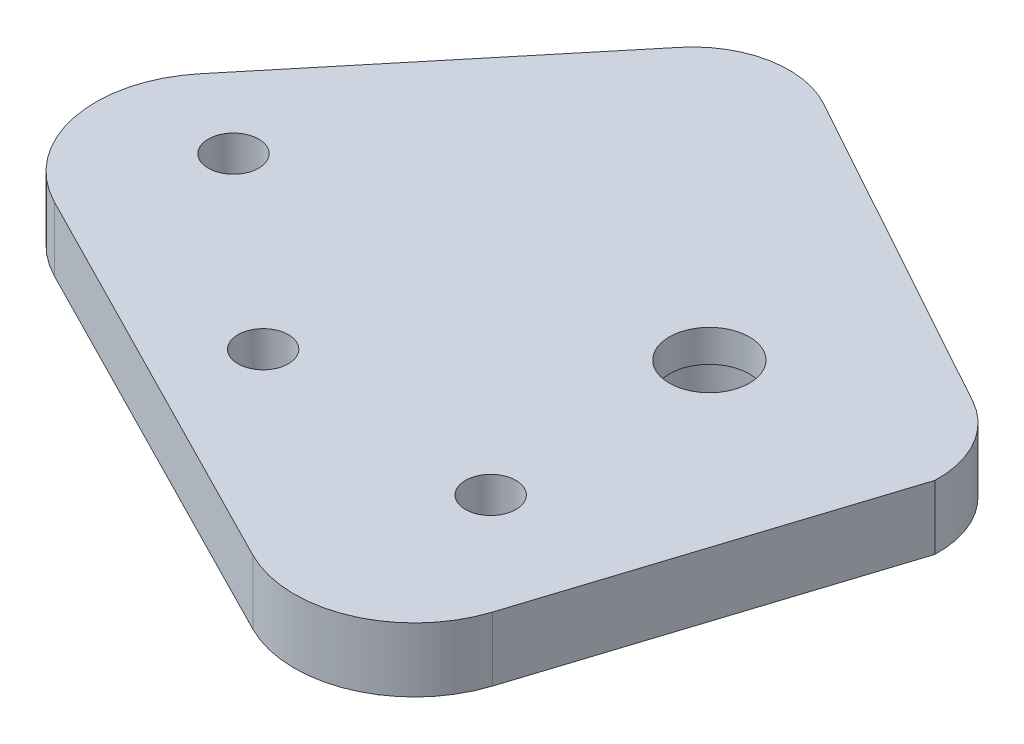
ISO-10303-21;
HEADER;
FILE_DESCRIPTION(('STEP AP214'),'2;1');
FILE_NAME('part.step','',(''),(''),'','','');
FILE_SCHEMA(('AUTOMOTIVE_DESIGN { 1 0 10303 214 1 1 1 1 }'));
ENDSEC;
DATA;
#1=APPLICATION_CONTEXT('core data for automotive mechanical design processes');
#2=APPLICATION_PROTOCOL_DEFINITION('international standard','automotive_design',2000,#1);
#3=PRODUCT_CONTEXT('',#1,'mechanical');
#4=PRODUCT('Part','Part','',(#3));
#5=PRODUCT_RELATED_PRODUCT_CATEGORY('part','',(#4));
#6=PRODUCT_DEFINITION_FORMATION('','',#4);
#7=PRODUCT_DEFINITION_CONTEXT('part definition',#1,'design');
#8=PRODUCT_DEFINITION('design','',#6,#7);
#9=PRODUCT_DEFINITION_SHAPE('','',#8);
#10=(LENGTH_UNIT() NAMED_UNIT(*) SI_UNIT(.MILLI.,.METRE.));
#11=(NAMED_UNIT(*) PLANE_ANGLE_UNIT() SI_UNIT($,.RADIAN.));
#12=(NAMED_UNIT(*) SI_UNIT($,.STERADIAN.) SOLID_ANGLE_UNIT());
#13=UNCERTAINTY_MEASURE_WITH_UNIT(LENGTH_MEASURE(1.E-05),#10,'distance_accuracy_value','');
#14=(GEOMETRIC_REPRESENTATION_CONTEXT(3) GLOBAL_UNCERTAINTY_ASSIGNED_CONTEXT((#13)) GLOBAL_UNIT_ASSIGNED_CONTEXT((#10,
#11,#12)) REPRESENTATION_CONTEXT('',''));
#15=CARTESIAN_POINT('',(0.,0.,0.));
#16=DIRECTION('',(0.,0.,1.));
#17=DIRECTION('',(1.,0.,0.));
#18=AXIS2_PLACEMENT_3D('',#15,#16,#17);
#19=CARTESIAN_POINT('',(28.0062938228443,10.,-31.6875316279944));
#20=DIRECTION('',(0.,-1.,0.));
#21=DIRECTION('',(0.,0.,-1.));
#22=AXIS2_PLACEMENT_3D('',#19,#20,#21);
#23=CYLINDRICAL_SURFACE('',#22,5.);
#24=CARTESIAN_POINT('',(28.0062938228443,8.,-31.6875316279944));
#25=DIRECTION('',(0.,1.,0.));
#26=DIRECTION('',(0.,0.,1.));
#27=AXIS2_PLACEMENT_3D('',#24,#25,#26);
#28=CIRCLE('',#27,5.);
#29=CARTESIAN_POINT('',(28.0062938228443,8.,-26.6875316279944));
#30=VERTEX_POINT('',#29);
#31=EDGE_CURVE('E129',#30,#30,#28,.T.);
#32=ORIENTED_EDGE('',*,*,#31,.T.);
#33=EDGE_LOOP('',(#32));
#34=FACE_BOUND('',#33,.T.);
#35=CARTESIAN_POINT('',(28.0062938228443,4.,-31.6875316279944));
#36=DIRECTION('',(0.,-1.,0.));
#37=DIRECTION('',(0.,0.,-1.));
#38=AXIS2_PLACEMENT_3D('',#35,#36,#37);
#39=CIRCLE('',#38,5.);
#40=CARTESIAN_POINT('',(28.0062938228443,4.,-36.6875316279944));
#41=VERTEX_POINT('',#40);
#42=EDGE_CURVE('E134',#41,#41,#39,.F.);
#43=ORIENTED_EDGE('',*,*,#42,.F.);
#44=EDGE_LOOP('',(#43));
#45=FACE_BOUND('',#44,.T.);
#46=ADVANCED_FACE('F35',(#34,#45),#23,.F.);
#47=CARTESIAN_POINT('',(0.,8.,0.));
#48=DIRECTION('',(0.,1.,0.));
#49=DIRECTION('',(0.,0.,1.));
#50=AXIS2_PLACEMENT_3D('',#47,#48,#49);
#51=PLANE('',#50);
#52=CARTESIAN_POINT('',(-0.992606529105151,8.,-5.0236580569629));
#53=DIRECTION('',(0.,1.,0.));
#54=DIRECTION('',(0.,0.,1.));
#55=AXIS2_PLACEMENT_3D('',#52,#53,#54);
#56=CIRCLE('',#55,3.15);
#57=CARTESIAN_POINT('',(-0.992606529105151,8.,-1.8736580569629));
#58=VERTEX_POINT('',#57);
#59=EDGE_CURVE('E184',#58,#58,#56,.T.);
#60=ORIENTED_EDGE('',*,*,#59,.F.);
#61=EDGE_LOOP('',(#60));
#62=FACE_BOUND('',#61,.T.);
#63=CARTESIAN_POINT('',(-23.9739398226746,8.,-24.3072863475589));
#64=DIRECTION('',(0.,1.,0.));
#65=DIRECTION('',(0.,0.,1.));
#66=AXIS2_PLACEMENT_3D('',#63,#64,#65);
#67=CIRCLE('',#66,3.15);
#68=CARTESIAN_POINT('',(-23.9739398226746,8.,-21.1572863475589));
#69=VERTEX_POINT('',#68);
#70=EDGE_CURVE('E190',#69,#69,#67,.T.);
#71=ORIENTED_EDGE('',*,*,#70,.F.);
#72=EDGE_LOOP('',(#71));
#73=FACE_BOUND('',#72,.T.);
#74=ORIENTED_EDGE('',*,*,#31,.F.);
#75=EDGE_LOOP('',(#74));
#76=FACE_BOUND('',#75,.T.);
#77=DIRECTION('',(-0.636819465384265,0.,0.771012949636839));
#78=VECTOR('',#77,1.);
#79=CARTESIAN_POINT('',(-33.8725664929582,8.,-31.8418333630491));
#80=LINE('',#79,#78);
#81=CARTESIAN_POINT('',(-7.61091382212576,8.,-63.637460520675));
#82=VERTEX_POINT('',#81);
#83=CARTESIAN_POINT('',(-34.7004740837701,8.,-30.8394653320508));
#84=VERTEX_POINT('',#83);
#85=EDGE_CURVE('E163',#82,#84,#80,.T.);
#86=ORIENTED_EDGE('',*,*,#85,.T.);
#87=CARTESIAN_POINT('',(-23.1352798392176,8.,-21.2871733512868));
#88=DIRECTION('',(0.,1.,0.));
#89=DIRECTION('',(0.,0.,-1.));
#90=AXIS2_PLACEMENT_3D('',#87,#88,#89);
#91=CIRCLE('',#90,15.);
#92=CARTESIAN_POINT('',(-29.9507774972821,8.,-7.92495079390816));
#93=VERTEX_POINT('',#92);
#94=EDGE_CURVE('E166',#84,#93,#91,.T.);
#95=ORIENTED_EDGE('',*,*,#94,.T.);
#96=DIRECTION('',(0.89081483715857,0.,0.45436651053764));
#97=VECTOR('',#96,1.);
#98=CARTESIAN_POINT('',(-29.9507774972821,8.,-7.92495079390816));
#99=LINE('',#98,#97);
#100=CARTESIAN_POINT('',(20.6028618538417,8.,17.8602963178434));
#101=VERTEX_POINT('',#100);
#102=EDGE_CURVE('E126',#93,#101,#99,.T.);
#103=ORIENTED_EDGE('',*,*,#102,.T.);
#104=CARTESIAN_POINT('',(27.4183595119064,8.,4.49807376046491));
#105=DIRECTION('',(0.,1.,0.));
#106=DIRECTION('',(0.,0.,-1.));
#107=AXIS2_PLACEMENT_3D('',#104,#105,#106);
#108=CIRCLE('',#107,15.);
#109=CARTESIAN_POINT('',(41.7062632420237,8.,9.06488960948927));
#110=VERTEX_POINT('',#109);
#111=EDGE_CURVE('E131',#101,#110,#108,.T.);
#112=ORIENTED_EDGE('',*,*,#111,.T.);
#113=DIRECTION('',(0.304454389934964,0.,-0.952526915341151));
#114=VECTOR('',#113,1.);
#115=CARTESIAN_POINT('',(55.073012073876,8.,-32.7547998213774));
#116=LINE('',#115,#114);
#117=CARTESIAN_POINT('',(55.073012073876,8.,-32.7547998213774));
#118=VERTEX_POINT('',#117);
#119=EDGE_CURVE('E151',#110,#118,#116,.T.);
#120=ORIENTED_EDGE('',*,*,#119,.T.);
#121=CARTESIAN_POINT('',(43.0800770552335,8.,-33.1665153039853));
#122=DIRECTION('',(0.,1.,0.));
#123=DIRECTION('',(0.,0.,1.));
#124=AXIS2_PLACEMENT_3D('',#121,#122,#123);
#125=CIRCLE('',#124,12.);
#126=CARTESIAN_POINT('',(48.8704522288658,8.,-43.6770602636238));
#127=VERTEX_POINT('',#126);
#128=EDGE_CURVE('E154',#118,#127,#125,.T.);
#129=ORIENTED_EDGE('',*,*,#128,.T.);
#130=DIRECTION('',(-0.875878746636543,0.,-0.482531264469359));
#131=VECTOR('',#130,1.);
#132=CARTESIAN_POINT('',(7.43161674714873,8.,-66.5061718957024));
#133=LINE('',#132,#131);
#134=CARTESIAN_POINT('',(7.43161674714873,8.,-66.5061718957024));
#135=VERTEX_POINT('',#134);
#136=EDGE_CURVE('E157',#127,#135,#133,.T.);
#137=ORIENTED_EDGE('',*,*,#136,.T.);
#138=CARTESIAN_POINT('',(1.64124157351635,8.,-55.9956269360639));
#139=DIRECTION('',(0.,1.,0.));
#140=DIRECTION('',(0.,0.,1.));
#141=AXIS2_PLACEMENT_3D('',#138,#139,#140);
#142=CIRCLE('',#141,12.);
#143=EDGE_CURVE('E160',#135,#82,#142,.T.);
#144=ORIENTED_EDGE('',*,*,#143,.T.);
#145=EDGE_LOOP('',(#86,#95,#103,#112,#120,#129,#137,#144));
#146=FACE_BOUND('',#145,.T.);
#147=CARTESIAN_POINT('',(28.9418086927213,8.,-3.47388979312591));
#148=DIRECTION('',(0.,-1.,0.));
#149=DIRECTION('',(0.,0.,-1.));
#150=AXIS2_PLACEMENT_3D('',#147,#148,#149);
#151=CIRCLE('',#150,3.15);
#152=CARTESIAN_POINT('',(28.9418086927213,8.,-6.62388979312591));
#153=VERTEX_POINT('',#152);
#154=EDGE_CURVE('E11',#153,#153,#151,.T.);
#155=ORIENTED_EDGE('',*,*,#154,.T.);
#156=EDGE_LOOP('',(#155));
#157=FACE_BOUND('',#156,.T.);
#158=ADVANCED_FACE('F206',(#62,#73,#76,#146,#157),#51,.T.);
#159=CARTESIAN_POINT('',(0.,0.,0.));
#160=DIRECTION('',(0.,1.,0.));
#161=DIRECTION('',(0.,0.,1.));
#162=AXIS2_PLACEMENT_3D('',#159,#160,#161);
#163=PLANE('',#162);
#164=CARTESIAN_POINT('',(-0.992606529105151,0.,-5.0236580569629));
#165=DIRECTION('',(0.,1.,0.));
#166=DIRECTION('',(0.,0.,1.));
#167=AXIS2_PLACEMENT_3D('',#164,#165,#166);
#168=CIRCLE('',#167,3.15);
#169=CARTESIAN_POINT('',(-0.992606529105151,0.,-1.8736580569629));
#170=VERTEX_POINT('',#169);
#171=EDGE_CURVE('E39',#170,#170,#168,.T.);
#172=ORIENTED_EDGE('',*,*,#171,.T.);
#173=EDGE_LOOP('',(#172));
#174=FACE_BOUND('',#173,.T.);
#175=CARTESIAN_POINT('',(-23.9739398226746,0.,-24.3072863475589));
#176=DIRECTION('',(0.,1.,0.));
#177=DIRECTION('',(0.,0.,1.));
#178=AXIS2_PLACEMENT_3D('',#175,#176,#177);
#179=CIRCLE('',#178,3.15);
#180=CARTESIAN_POINT('',(-23.9739398226746,0.,-21.1572863475589));
#181=VERTEX_POINT('',#180);
#182=EDGE_CURVE('E182',#181,#181,#179,.T.);
#183=ORIENTED_EDGE('',*,*,#182,.T.);
#184=EDGE_LOOP('',(#183));
#185=FACE_BOUND('',#184,.T.);
#186=CARTESIAN_POINT('',(28.0062938228443,0.,-31.6875316279944));
#187=DIRECTION('',(0.,-1.,0.));
#188=DIRECTION('',(0.,0.,-1.));
#189=AXIS2_PLACEMENT_3D('',#186,#187,#188);
#190=CIRCLE('',#189,6.00000000000001);
#191=CARTESIAN_POINT('',(28.0062938228443,0.,-37.6875316279944));
#192=VERTEX_POINT('',#191);
#193=EDGE_CURVE('E188',#192,#192,#190,.T.);
#194=ORIENTED_EDGE('',*,*,#193,.F.);
#195=EDGE_LOOP('',(#194));
#196=FACE_BOUND('',#195,.T.);
#197=CARTESIAN_POINT('',(-23.1352798392176,0.,-21.2871733512868));
#198=DIRECTION('',(0.,1.,0.));
#199=DIRECTION('',(0.,0.,-1.));
#200=AXIS2_PLACEMENT_3D('',#197,#198,#199);
#201=CIRCLE('',#200,15.);
#202=CARTESIAN_POINT('',(-34.7004740837701,0.,-30.8394653320508));
#203=VERTEX_POINT('',#202);
#204=CARTESIAN_POINT('',(-29.9507774972821,0.,-7.92495079390816));
#205=VERTEX_POINT('',#204);
#206=EDGE_CURVE('E108',#203,#205,#201,.T.);
#207=ORIENTED_EDGE('',*,*,#206,.F.);
#208=DIRECTION('',(-0.636819465384265,0.,0.771012949636839));
#209=VECTOR('',#208,1.);
#210=CARTESIAN_POINT('',(-33.8725664929582,0.,-31.8418333630491));
#211=LINE('',#210,#209);
#212=CARTESIAN_POINT('',(-7.61091382212576,0.,-63.637460520675));
#213=VERTEX_POINT('',#212);
#214=EDGE_CURVE('E123',#213,#203,#211,.T.);
#215=ORIENTED_EDGE('',*,*,#214,.F.);
#216=CARTESIAN_POINT('',(1.64124157351635,0.,-55.9956269360639));
#217=DIRECTION('',(0.,1.,0.));
#218=DIRECTION('',(0.,0.,1.));
#219=AXIS2_PLACEMENT_3D('',#216,#217,#218);
#220=CIRCLE('',#219,12.);
#221=CARTESIAN_POINT('',(7.43161674714873,0.,-66.5061718957024));
#222=VERTEX_POINT('',#221);
#223=EDGE_CURVE('E145',#222,#213,#220,.T.);
#224=ORIENTED_EDGE('',*,*,#223,.F.);
#225=DIRECTION('',(-0.875878746636543,0.,-0.482531264469359));
#226=VECTOR('',#225,1.);
#227=CARTESIAN_POINT('',(7.43161674714873,0.,-66.5061718957024));
#228=LINE('',#227,#226);
#229=CARTESIAN_POINT('',(48.8704522288658,0.,-43.6770602636238));
#230=VERTEX_POINT('',#229);
#231=EDGE_CURVE('E142',#230,#222,#228,.T.);
#232=ORIENTED_EDGE('',*,*,#231,.F.);
#233=CARTESIAN_POINT('',(43.0800770552335,0.,-33.1665153039853));
#234=DIRECTION('',(0.,1.,0.));
#235=DIRECTION('',(0.,0.,1.));
#236=AXIS2_PLACEMENT_3D('',#233,#234,#235);
#237=CIRCLE('',#236,12.);
#238=CARTESIAN_POINT('',(55.073012073876,0.,-32.7547998213774));
#239=VERTEX_POINT('',#238);
#240=EDGE_CURVE('E140',#239,#230,#237,.T.);
#241=ORIENTED_EDGE('',*,*,#240,.F.);
#242=DIRECTION('',(0.304454389934964,0.,-0.952526915341151));
#243=VECTOR('',#242,1.);
#244=CARTESIAN_POINT('',(55.073012073876,0.,-32.7547998213774));
#245=LINE('',#244,#243);
#246=CARTESIAN_POINT('',(41.7062632420237,0.,9.06488960948927));
#247=VERTEX_POINT('',#246);
#248=EDGE_CURVE('E138',#247,#239,#245,.T.);
#249=ORIENTED_EDGE('',*,*,#248,.F.);
#250=CARTESIAN_POINT('',(27.4183595119064,0.,4.49807376046491));
#251=DIRECTION('',(0.,1.,0.));
#252=DIRECTION('',(0.,0.,-1.));
#253=AXIS2_PLACEMENT_3D('',#250,#251,#252);
#254=CIRCLE('',#253,15.);
#255=CARTESIAN_POINT('',(20.6028618538417,0.,17.8602963178434));
#256=VERTEX_POINT('',#255);
#257=EDGE_CURVE('E110',#256,#247,#254,.T.);
#258=ORIENTED_EDGE('',*,*,#257,.F.);
#259=DIRECTION('',(0.89081483715857,0.,0.45436651053764));
#260=VECTOR('',#259,1.);
#261=CARTESIAN_POINT('',(-29.9507774972821,0.,-7.92495079390816));
#262=LINE('',#261,#260);
#263=EDGE_CURVE('E104',#205,#256,#262,.T.);
#264=ORIENTED_EDGE('',*,*,#263,.F.);
#265=EDGE_LOOP('',(#207,#215,#224,#232,#241,#249,#258,#264));
#266=FACE_BOUND('',#265,.T.);
#267=CARTESIAN_POINT('',(28.9418086927213,0.,-3.47388979312591));
#268=DIRECTION('',(0.,-1.,0.));
#269=DIRECTION('',(0.,0.,-1.));
#270=AXIS2_PLACEMENT_3D('',#267,#268,#269);
#271=CIRCLE('',#270,3.15);
#272=CARTESIAN_POINT('',(28.9418086927213,0.,-6.62388979312591));
#273=VERTEX_POINT('',#272);
#274=EDGE_CURVE('E44',#273,#273,#271,.T.);
#275=ORIENTED_EDGE('',*,*,#274,.F.);
#276=EDGE_LOOP('',(#275));
#277=FACE_BOUND('',#276,.T.);
#278=ADVANCED_FACE('F37',(#174,#185,#196,#266,#277),#163,.F.);
#279=CARTESIAN_POINT('',(28.9418086927213,8.,-3.47388979312591));
#280=DIRECTION('',(0.,-1.,0.));
#281=DIRECTION('',(0.,0.,-1.));
#282=AXIS2_PLACEMENT_3D('',#279,#280,#281);
#283=CYLINDRICAL_SURFACE('',#282,3.15);
#284=ORIENTED_EDGE('',*,*,#154,.F.);
#285=EDGE_LOOP('',(#284));
#286=FACE_BOUND('',#285,.T.);
#287=ORIENTED_EDGE('',*,*,#274,.T.);
#288=EDGE_LOOP('',(#287));
#289=FACE_BOUND('',#288,.T.);
#290=ADVANCED_FACE('F205',(#286,#289),#283,.F.);
#291=CARTESIAN_POINT('',(-29.9507774972821,0.,-7.92495079390816));
#292=DIRECTION('',(-0.45436651053764,0.,0.89081483715857));
#293=DIRECTION('',(0.89081483715857,0.,0.45436651053764));
#294=AXIS2_PLACEMENT_3D('',#291,#292,#293);
#295=PLANE('',#294);
#296=ORIENTED_EDGE('',*,*,#263,.T.);
#297=DIRECTION('',(0.,1.,0.));
#298=VECTOR('',#297,1.);
#299=CARTESIAN_POINT('',(20.6028618538417,0.,17.8602963178434));
#300=LINE('',#299,#298);
#301=EDGE_CURVE('E128',#256,#101,#300,.T.);
#302=ORIENTED_EDGE('',*,*,#301,.T.);
#303=ORIENTED_EDGE('',*,*,#102,.F.);
#304=DIRECTION('',(0.,1.,0.));
#305=VECTOR('',#304,1.);
#306=CARTESIAN_POINT('',(-29.9507774972821,0.,-7.92495079390816));
#307=LINE('',#306,#305);
#308=EDGE_CURVE('E120',#205,#93,#307,.T.);
#309=ORIENTED_EDGE('',*,*,#308,.F.);
#310=EDGE_LOOP('',(#296,#302,#303,#309));
#311=FACE_BOUND('',#310,.T.);
#312=ADVANCED_FACE('F125',(#311),#295,.T.);
#313=CARTESIAN_POINT('',(27.4183595119064,0.,4.49807376046491));
#314=DIRECTION('',(0.,1.,0.));
#315=DIRECTION('',(0.,0.,1.));
#316=AXIS2_PLACEMENT_3D('',#313,#314,#315);
#317=CYLINDRICAL_SURFACE('',#316,15.);
#318=ORIENTED_EDGE('',*,*,#257,.T.);
#319=DIRECTION('',(0.,1.,0.));
#320=VECTOR('',#319,1.);
#321=CARTESIAN_POINT('',(41.7062632420237,0.,9.06488960948927));
#322=LINE('',#321,#320);
#323=EDGE_CURVE('E60',#247,#110,#322,.T.);
#324=ORIENTED_EDGE('',*,*,#323,.T.);
#325=ORIENTED_EDGE('',*,*,#111,.F.);
#326=ORIENTED_EDGE('',*,*,#301,.F.);
#327=EDGE_LOOP('',(#318,#324,#325,#326));
#328=FACE_BOUND('',#327,.T.);
#329=ADVANCED_FACE('F226',(#328),#317,.T.);
#330=CARTESIAN_POINT('',(-23.1352798392176,0.,-21.2871733512868));
#331=DIRECTION('',(0.,1.,0.));
#332=DIRECTION('',(0.,0.,1.));
#333=AXIS2_PLACEMENT_3D('',#330,#331,#332);
#334=CYLINDRICAL_SURFACE('',#333,15.);
#335=ORIENTED_EDGE('',*,*,#94,.F.);
#336=DIRECTION('',(0.,1.,0.));
#337=VECTOR('',#336,1.);
#338=CARTESIAN_POINT('',(-34.7004740837701,0.,-30.8394653320508));
#339=LINE('',#338,#337);
#340=EDGE_CURVE('E121',#203,#84,#339,.T.);
#341=ORIENTED_EDGE('',*,*,#340,.F.);
#342=ORIENTED_EDGE('',*,*,#206,.T.);
#343=ORIENTED_EDGE('',*,*,#308,.T.);
#344=EDGE_LOOP('',(#335,#341,#342,#343));
#345=FACE_BOUND('',#344,.T.);
#346=ADVANCED_FACE('F119',(#345),#334,.T.);
#347=CARTESIAN_POINT('',(-33.8725664929582,0.,-31.8418333630491));
#348=DIRECTION('',(-0.771012949636839,0.,-0.636819465384265));
#349=DIRECTION('',(-0.636819465384265,0.,0.771012949636839));
#350=AXIS2_PLACEMENT_3D('',#347,#348,#349);
#351=PLANE('',#350);
#352=ORIENTED_EDGE('',*,*,#85,.F.);
#353=DIRECTION('',(0.,1.,0.));
#354=VECTOR('',#353,1.);
#355=CARTESIAN_POINT('',(-7.61091382212576,0.,-63.637460520675));
#356=LINE('',#355,#354);
#357=EDGE_CURVE('E170',#213,#82,#356,.T.);
#358=ORIENTED_EDGE('',*,*,#357,.F.);
#359=ORIENTED_EDGE('',*,*,#214,.T.);
#360=ORIENTED_EDGE('',*,*,#340,.T.);
#361=EDGE_LOOP('',(#352,#358,#359,#360));
#362=FACE_BOUND('',#361,.T.);
#363=ADVANCED_FACE('F229',(#362),#351,.T.);
#364=CARTESIAN_POINT('',(1.64124157351635,0.,-55.9956269360639));
#365=DIRECTION('',(0.,1.,0.));
#366=DIRECTION('',(0.,0.,1.));
#367=AXIS2_PLACEMENT_3D('',#364,#365,#366);
#368=CYLINDRICAL_SURFACE('',#367,12.);
#369=ORIENTED_EDGE('',*,*,#143,.F.);
#370=DIRECTION('',(0.,1.,0.));
#371=VECTOR('',#370,1.);
#372=CARTESIAN_POINT('',(7.43161674714873,0.,-66.5061718957024));
#373=LINE('',#372,#371);
#374=EDGE_CURVE('E172',#222,#135,#373,.T.);
#375=ORIENTED_EDGE('',*,*,#374,.F.);
#376=ORIENTED_EDGE('',*,*,#223,.T.);
#377=ORIENTED_EDGE('',*,*,#357,.T.);
#378=EDGE_LOOP('',(#369,#375,#376,#377));
#379=FACE_BOUND('',#378,.T.);
#380=ADVANCED_FACE('F232',(#379),#368,.T.);
#381=CARTESIAN_POINT('',(7.43161674714873,0.,-66.5061718957024));
#382=DIRECTION('',(0.482531264469359,0.,-0.875878746636543));
#383=DIRECTION('',(-0.875878746636543,0.,-0.482531264469359));
#384=AXIS2_PLACEMENT_3D('',#381,#382,#383);
#385=PLANE('',#384);
#386=ORIENTED_EDGE('',*,*,#136,.F.);
#387=DIRECTION('',(0.,1.,0.));
#388=VECTOR('',#387,1.);
#389=CARTESIAN_POINT('',(48.8704522288658,0.,-43.6770602636238));
#390=LINE('',#389,#388);
#391=EDGE_CURVE('E174',#230,#127,#390,.T.);
#392=ORIENTED_EDGE('',*,*,#391,.F.);
#393=ORIENTED_EDGE('',*,*,#231,.T.);
#394=ORIENTED_EDGE('',*,*,#374,.T.);
#395=EDGE_LOOP('',(#386,#392,#393,#394));
#396=FACE_BOUND('',#395,.T.);
#397=ADVANCED_FACE('F236',(#396),#385,.T.);
#398=CARTESIAN_POINT('',(43.0800770552335,0.,-33.1665153039853));
#399=DIRECTION('',(0.,1.,0.));
#400=DIRECTION('',(0.,0.,1.));
#401=AXIS2_PLACEMENT_3D('',#398,#399,#400);
#402=CYLINDRICAL_SURFACE('',#401,12.);
#403=ORIENTED_EDGE('',*,*,#128,.F.);
#404=DIRECTION('',(0.,1.,0.));
#405=VECTOR('',#404,1.);
#406=CARTESIAN_POINT('',(55.073012073876,0.,-32.7547998213774));
#407=LINE('',#406,#405);
#408=EDGE_CURVE('E52',#239,#118,#407,.T.);
#409=ORIENTED_EDGE('',*,*,#408,.F.);
#410=ORIENTED_EDGE('',*,*,#240,.T.);
#411=ORIENTED_EDGE('',*,*,#391,.T.);
#412=EDGE_LOOP('',(#403,#409,#410,#411));
#413=FACE_BOUND('',#412,.T.);
#414=ADVANCED_FACE('F240',(#413),#402,.T.);
#415=CARTESIAN_POINT('',(55.073012073876,0.,-32.7547998213774));
#416=DIRECTION('',(0.952526915341151,0.,0.304454389934964));
#417=DIRECTION('',(0.304454389934964,0.,-0.952526915341151));
#418=AXIS2_PLACEMENT_3D('',#415,#416,#417);
#419=PLANE('',#418);
#420=ORIENTED_EDGE('',*,*,#119,.F.);
#421=ORIENTED_EDGE('',*,*,#323,.F.);
#422=ORIENTED_EDGE('',*,*,#248,.T.);
#423=ORIENTED_EDGE('',*,*,#408,.T.);
#424=EDGE_LOOP('',(#420,#421,#422,#423));
#425=FACE_BOUND('',#424,.T.);
#426=ADVANCED_FACE('F244',(#425),#419,.T.);
#427=CARTESIAN_POINT('',(28.0062938228443,4.,-31.6875316279944));
#428=DIRECTION('',(0.,-1.,0.));
#429=DIRECTION('',(0.,0.,-1.));
#430=AXIS2_PLACEMENT_3D('',#427,#428,#429);
#431=PLANE('',#430);
#432=CARTESIAN_POINT('',(28.0062938228443,4.,-31.6875316279944));
#433=DIRECTION('',(0.,-1.,0.));
#434=DIRECTION('',(0.,0.,-1.));
#435=AXIS2_PLACEMENT_3D('',#432,#433,#434);
#436=CIRCLE('',#435,6.00000000000001);
#437=CARTESIAN_POINT('',(28.0062938228443,4.,-37.6875316279944));
#438=VERTEX_POINT('',#437);
#439=EDGE_CURVE('E181',#438,#438,#436,.T.);
#440=ORIENTED_EDGE('',*,*,#439,.T.);
#441=EDGE_LOOP('',(#440));
#442=FACE_BOUND('',#441,.T.);
#443=ORIENTED_EDGE('',*,*,#42,.T.);
#444=EDGE_LOOP('',(#443));
#445=FACE_BOUND('',#444,.T.);
#446=ADVANCED_FACE('F247',(#442,#445),#431,.T.);
#447=CARTESIAN_POINT('',(28.0062938228443,4.,-31.6875316279944));
#448=DIRECTION('',(0.,-1.,0.));
#449=DIRECTION('',(0.,0.,-1.));
#450=AXIS2_PLACEMENT_3D('',#447,#448,#449);
#451=CYLINDRICAL_SURFACE('',#450,6.00000000000001);
#452=ORIENTED_EDGE('',*,*,#439,.F.);
#453=EDGE_LOOP('',(#452));
#454=FACE_BOUND('',#453,.T.);
#455=ORIENTED_EDGE('',*,*,#193,.T.);
#456=EDGE_LOOP('',(#455));
#457=FACE_BOUND('',#456,.T.);
#458=ADVANCED_FACE('F202',(#454,#457),#451,.F.);
#459=CARTESIAN_POINT('',(-23.9739398226746,-40.,-24.3072863475589));
#460=DIRECTION('',(0.,1.,0.));
#461=DIRECTION('',(0.,0.,1.));
#462=AXIS2_PLACEMENT_3D('',#459,#460,#461);
#463=CYLINDRICAL_SURFACE('',#462,3.15);
#464=ORIENTED_EDGE('',*,*,#70,.T.);
#465=EDGE_LOOP('',(#464));
#466=FACE_BOUND('',#465,.T.);
#467=ORIENTED_EDGE('',*,*,#182,.F.);
#468=EDGE_LOOP('',(#467));
#469=FACE_BOUND('',#468,.T.);
#470=ADVANCED_FACE('F302',(#466,#469),#463,.F.);
#471=CARTESIAN_POINT('',(-0.992606529105151,-40.,-5.0236580569629));
#472=DIRECTION('',(0.,1.,0.));
#473=DIRECTION('',(0.,0.,1.));
#474=AXIS2_PLACEMENT_3D('',#471,#472,#473);
#475=CYLINDRICAL_SURFACE('',#474,3.15);
#476=ORIENTED_EDGE('',*,*,#59,.T.);
#477=EDGE_LOOP('',(#476));
#478=FACE_BOUND('',#477,.T.);
#479=ORIENTED_EDGE('',*,*,#171,.F.);
#480=EDGE_LOOP('',(#479));
#481=FACE_BOUND('',#480,.T.);
#482=ADVANCED_FACE('F310',(#478,#481),#475,.F.);
#483=CLOSED_SHELL('',(#46,#158,#278,#290,#312,#329,#346,#363,#380,#397,#414,#426,#446,#458,#470,#482));
#484=MANIFOLD_SOLID_BREP('B2',#483);
#485=ADVANCED_BREP_SHAPE_REPRESENTATION('',(#18,#484),#14);
#486=SHAPE_DEFINITION_REPRESENTATION(#9,#485);
ENDSEC;
END-ISO-10303-21;
